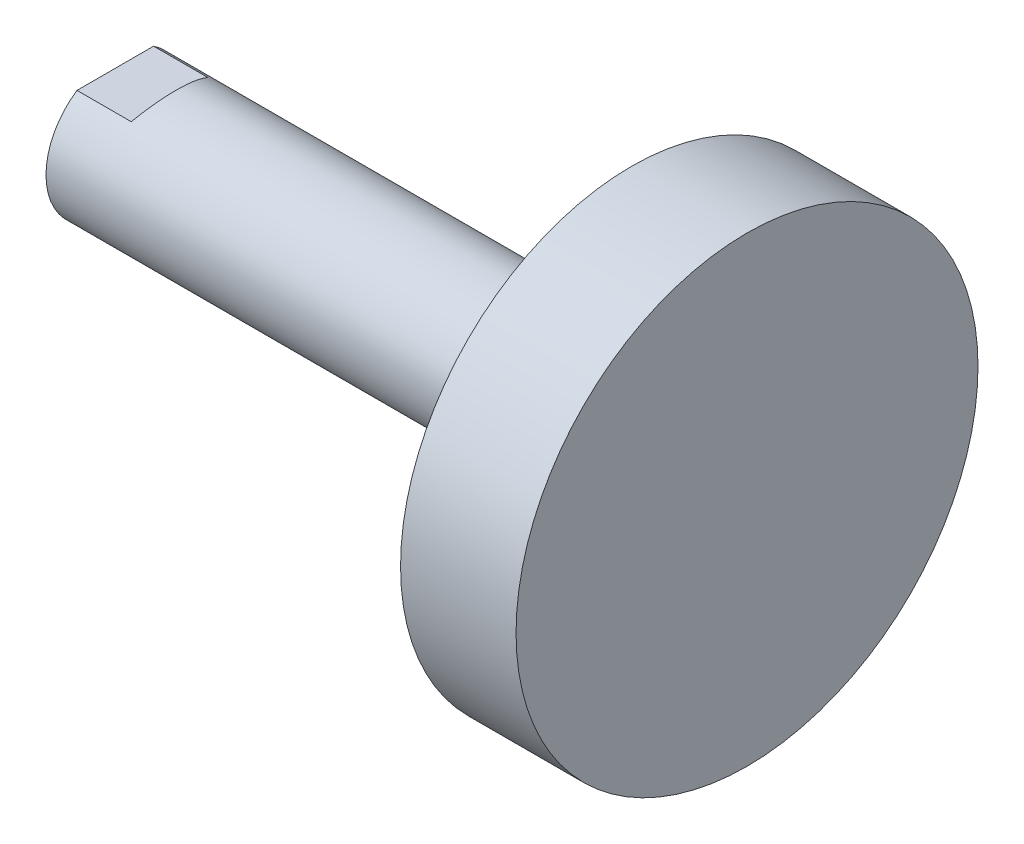
ISO-10303-21;
HEADER;
FILE_DESCRIPTION(('STEP AP214'),'2;1');
FILE_NAME('part.step','',(''),(''),'','','');
FILE_SCHEMA(('AUTOMOTIVE_DESIGN { 1 0 10303 214 1 1 1 1 }'));
ENDSEC;
DATA;
#1=APPLICATION_CONTEXT('core data for automotive mechanical design processes');
#2=APPLICATION_PROTOCOL_DEFINITION('international standard','automotive_design',2000,#1);
#3=PRODUCT_CONTEXT('',#1,'mechanical');
#4=PRODUCT('Part','Part','',(#3));
#5=PRODUCT_RELATED_PRODUCT_CATEGORY('part','',(#4));
#6=PRODUCT_DEFINITION_FORMATION('','',#4);
#7=PRODUCT_DEFINITION_CONTEXT('part definition',#1,'design');
#8=PRODUCT_DEFINITION('design','',#6,#7);
#9=PRODUCT_DEFINITION_SHAPE('','',#8);
#10=(LENGTH_UNIT() NAMED_UNIT(*) SI_UNIT(.MILLI.,.METRE.));
#11=(NAMED_UNIT(*) PLANE_ANGLE_UNIT() SI_UNIT($,.RADIAN.));
#12=(NAMED_UNIT(*) SI_UNIT($,.STERADIAN.) SOLID_ANGLE_UNIT());
#13=UNCERTAINTY_MEASURE_WITH_UNIT(LENGTH_MEASURE(1.E-05),#10,'distance_accuracy_value','');
#14=(GEOMETRIC_REPRESENTATION_CONTEXT(3) GLOBAL_UNCERTAINTY_ASSIGNED_CONTEXT((#13)) GLOBAL_UNIT_ASSIGNED_CONTEXT((#10,
#11,#12)) REPRESENTATION_CONTEXT('',''));
#15=CARTESIAN_POINT('',(0.,0.,0.));
#16=DIRECTION('',(0.,0.,1.));
#17=DIRECTION('',(1.,0.,0.));
#18=AXIS2_PLACEMENT_3D('',#15,#16,#17);
#19=CARTESIAN_POINT('',(-6.1,0.,0.));
#20=DIRECTION('',(1.,0.,0.));
#21=DIRECTION('',(0.,0.,-1.));
#22=AXIS2_PLACEMENT_3D('',#19,#20,#21);
#23=PLANE('',#22);
#24=CARTESIAN_POINT('',(-6.1,0.,0.));
#25=DIRECTION('',(-1.,0.,0.));
#26=DIRECTION('',(0.,0.,1.));
#27=AXIS2_PLACEMENT_3D('',#24,#25,#26);
#28=CIRCLE('',#27,6.);
#29=CARTESIAN_POINT('',(-6.1,-5.,3.3166247903554));
#30=VERTEX_POINT('',#29);
#31=CARTESIAN_POINT('',(-6.1,5.,3.3166247903554));
#32=VERTEX_POINT('',#31);
#33=EDGE_CURVE('E104',#30,#32,#28,.T.);
#34=ORIENTED_EDGE('',*,*,#33,.T.);
#35=DIRECTION('',(0.,0.,-1.));
#36=VECTOR('',#35,1.);
#37=CARTESIAN_POINT('',(-6.1,5.,0.));
#38=LINE('',#37,#36);
#39=CARTESIAN_POINT('',(-6.1,5.,-3.3166247903554));
#40=VERTEX_POINT('',#39);
#41=EDGE_CURVE('E142',#32,#40,#38,.T.);
#42=ORIENTED_EDGE('',*,*,#41,.T.);
#43=CARTESIAN_POINT('',(-6.1,-5.,-3.3166247903554));
#44=VERTEX_POINT('',#43);
#45=EDGE_CURVE('E136',#40,#44,#28,.T.);
#46=ORIENTED_EDGE('',*,*,#45,.T.);
#47=DIRECTION('',(0.,0.,1.));
#48=VECTOR('',#47,1.);
#49=CARTESIAN_POINT('',(-6.1,-5.,0.));
#50=LINE('',#49,#48);
#51=EDGE_CURVE('E140',#44,#30,#50,.T.);
#52=ORIENTED_EDGE('',*,*,#51,.T.);
#53=EDGE_LOOP('',(#34,#42,#46,#52));
#54=FACE_BOUND('',#53,.T.);
#55=CARTESIAN_POINT('',(-6.1,0.,0.));
#56=DIRECTION('',(-1.,0.,0.));
#57=DIRECTION('',(0.,0.,1.));
#58=AXIS2_PLACEMENT_3D('',#55,#56,#57);
#59=CIRCLE('',#58,4.8);
#60=CARTESIAN_POINT('',(-6.1,0.,4.8));
#61=VERTEX_POINT('',#60);
#62=EDGE_CURVE('E107',#61,#61,#59,.T.);
#63=ORIENTED_EDGE('',*,*,#62,.F.);
#64=EDGE_LOOP('',(#63));
#65=FACE_BOUND('',#64,.T.);
#66=ADVANCED_FACE('F38',(#54,#65),#23,.F.);
#67=CARTESIAN_POINT('',(48.6,0.,0.));
#68=DIRECTION('',(-1.,0.,0.));
#69=DIRECTION('',(0.,0.,1.));
#70=AXIS2_PLACEMENT_3D('',#67,#68,#69);
#71=CYLINDRICAL_SURFACE('',#70,6.);
#72=CARTESIAN_POINT('',(-4.28675134594813,0.,0.));
#73=DIRECTION('',(0.866025403784438,-0.500000000000001,0.));
#74=DIRECTION('',(-0.500000000000001,-0.866025403784438,0.));
#75=AXIS2_PLACEMENT_3D('',#72,#73,#74);
#76=ELLIPSE('',#75,6.92820323027551,6.);
#77=CARTESIAN_POINT('',(-1.4,5.,-3.3166247903554));
#78=VERTEX_POINT('',#77);
#79=CARTESIAN_POINT('',(-1.4,5.,3.3166247903554));
#80=VERTEX_POINT('',#79);
#81=EDGE_CURVE('E11',#78,#80,#76,.T.);
#82=ORIENTED_EDGE('',*,*,#81,.T.);
#83=DIRECTION('',(-1.,0.,0.));
#84=VECTOR('',#83,1.);
#85=CARTESIAN_POINT('',(48.6,5.,3.3166247903554));
#86=LINE('',#85,#84);
#87=EDGE_CURVE('E126',#80,#32,#86,.T.);
#88=ORIENTED_EDGE('',*,*,#87,.T.);
#89=ORIENTED_EDGE('',*,*,#33,.F.);
#90=DIRECTION('',(-1.,0.,0.));
#91=VECTOR('',#90,1.);
#92=CARTESIAN_POINT('',(48.6,-5.,3.3166247903554));
#93=LINE('',#92,#91);
#94=CARTESIAN_POINT('',(-1.4,-5.,3.3166247903554));
#95=VERTEX_POINT('',#94);
#96=EDGE_CURVE('E52',#30,#95,#93,.F.);
#97=ORIENTED_EDGE('',*,*,#96,.T.);
#98=CARTESIAN_POINT('',(-4.28675134594814,0.,0.));
#99=DIRECTION('',(0.866025403784438,0.500000000000001,0.));
#100=DIRECTION('',(-0.500000000000001,0.866025403784438,0.));
#101=AXIS2_PLACEMENT_3D('',#98,#99,#100);
#102=ELLIPSE('',#101,6.92820323027551,6.);
#103=CARTESIAN_POINT('',(-1.4,-5.,-3.31662479035539));
#104=VERTEX_POINT('',#103);
#105=EDGE_CURVE('E45',#95,#104,#102,.T.);
#106=ORIENTED_EDGE('',*,*,#105,.T.);
#107=DIRECTION('',(-1.,0.,0.));
#108=VECTOR('',#107,1.);
#109=CARTESIAN_POINT('',(48.6,-5.,-3.3166247903554));
#110=LINE('',#109,#108);
#111=EDGE_CURVE('E122',#104,#44,#110,.T.);
#112=ORIENTED_EDGE('',*,*,#111,.T.);
#113=ORIENTED_EDGE('',*,*,#45,.F.);
#114=DIRECTION('',(-1.,0.,0.));
#115=VECTOR('',#114,1.);
#116=CARTESIAN_POINT('',(48.6,5.,-3.3166247903554));
#117=LINE('',#116,#115);
#118=EDGE_CURVE('E60',#40,#78,#117,.F.);
#119=ORIENTED_EDGE('',*,*,#118,.T.);
#120=EDGE_LOOP('',(#82,#88,#89,#97,#106,#112,#113,#119));
#121=FACE_BOUND('',#120,.T.);
#122=CARTESIAN_POINT('',(38.6,0.,0.));
#123=DIRECTION('',(1.,0.,0.));
#124=DIRECTION('',(0.,0.,-1.));
#125=AXIS2_PLACEMENT_3D('',#122,#123,#124);
#126=CIRCLE('',#125,6.);
#127=CARTESIAN_POINT('',(38.6,0.,-6.));
#128=VERTEX_POINT('',#127);
#129=EDGE_CURVE('E137',#128,#128,#126,.T.);
#130=ORIENTED_EDGE('',*,*,#129,.F.);
#131=EDGE_LOOP('',(#130));
#132=FACE_BOUND('',#131,.T.);
#133=ADVANCED_FACE('F94',(#121,#132),#71,.T.);
#134=CARTESIAN_POINT('',(38.6,0.,0.));
#135=DIRECTION('',(1.,0.,0.));
#136=DIRECTION('',(0.,0.,-1.));
#137=AXIS2_PLACEMENT_3D('',#134,#135,#136);
#138=PLANE('',#137);
#139=CARTESIAN_POINT('',(38.6,0.,0.));
#140=DIRECTION('',(-1.,0.,0.));
#141=DIRECTION('',(0.,0.,1.));
#142=AXIS2_PLACEMENT_3D('',#139,#140,#141);
#143=CIRCLE('',#142,20.);
#144=CARTESIAN_POINT('',(38.6,0.,20.));
#145=VERTEX_POINT('',#144);
#146=EDGE_CURVE('E132',#145,#145,#143,.T.);
#147=ORIENTED_EDGE('',*,*,#146,.T.);
#148=EDGE_LOOP('',(#147));
#149=FACE_BOUND('',#148,.T.);
#150=ORIENTED_EDGE('',*,*,#129,.T.);
#151=EDGE_LOOP('',(#150));
#152=FACE_BOUND('',#151,.T.);
#153=ADVANCED_FACE('F99',(#149,#152),#138,.F.);
#154=CARTESIAN_POINT('',(48.6,0.,0.));
#155=DIRECTION('',(-1.,0.,0.));
#156=DIRECTION('',(0.,0.,1.));
#157=AXIS2_PLACEMENT_3D('',#154,#155,#156);
#158=CYLINDRICAL_SURFACE('',#157,20.);
#159=ORIENTED_EDGE('',*,*,#146,.F.);
#160=EDGE_LOOP('',(#159));
#161=FACE_BOUND('',#160,.T.);
#162=CARTESIAN_POINT('',(48.6,0.,0.));
#163=DIRECTION('',(-1.,0.,0.));
#164=DIRECTION('',(0.,0.,1.));
#165=AXIS2_PLACEMENT_3D('',#162,#163,#164);
#166=CIRCLE('',#165,20.);
#167=CARTESIAN_POINT('',(48.6,0.,20.));
#168=VERTEX_POINT('',#167);
#169=EDGE_CURVE('E129',#168,#168,#166,.T.);
#170=ORIENTED_EDGE('',*,*,#169,.T.);
#171=EDGE_LOOP('',(#170));
#172=FACE_BOUND('',#171,.T.);
#173=ADVANCED_FACE('F169',(#161,#172),#158,.T.);
#174=CARTESIAN_POINT('',(48.6,6.,0.));
#175=DIRECTION('',(-1.,0.,0.));
#176=DIRECTION('',(0.,0.,1.));
#177=AXIS2_PLACEMENT_3D('',#174,#175,#176);
#178=PLANE('',#177);
#179=ORIENTED_EDGE('',*,*,#169,.F.);
#180=EDGE_LOOP('',(#179));
#181=FACE_BOUND('',#180,.T.);
#182=ADVANCED_FACE('F167',(#181),#178,.F.);
#183=CARTESIAN_POINT('',(-1.4,-5.,-12.));
#184=DIRECTION('',(0.,1.,0.));
#185=DIRECTION('',(0.,0.,1.));
#186=AXIS2_PLACEMENT_3D('',#183,#184,#185);
#187=PLANE('',#186);
#188=DIRECTION('',(0.,0.,1.));
#189=VECTOR('',#188,1.);
#190=CARTESIAN_POINT('',(-1.4,-5.,-12.));
#191=LINE('',#190,#189);
#192=EDGE_CURVE('E109',#104,#95,#191,.T.);
#193=ORIENTED_EDGE('',*,*,#192,.T.);
#194=ORIENTED_EDGE('',*,*,#96,.F.);
#195=ORIENTED_EDGE('',*,*,#51,.F.);
#196=ORIENTED_EDGE('',*,*,#111,.F.);
#197=EDGE_LOOP('',(#193,#194,#195,#196));
#198=FACE_BOUND('',#197,.T.);
#199=ADVANCED_FACE('F150',(#198),#187,.F.);
#200=CARTESIAN_POINT('',(4.9508529610859,-16.,-12.));
#201=DIRECTION('',(0.866025403784438,0.500000000000001,0.));
#202=DIRECTION('',(-0.500000000000001,0.866025403784438,0.));
#203=AXIS2_PLACEMENT_3D('',#200,#201,#202);
#204=PLANE('',#203);
#205=ORIENTED_EDGE('',*,*,#192,.F.);
#206=ORIENTED_EDGE('',*,*,#105,.F.);
#207=EDGE_LOOP('',(#205,#206));
#208=FACE_BOUND('',#207,.T.);
#209=ADVANCED_FACE('F149',(#208),#204,.F.);
#210=CARTESIAN_POINT('',(-1.4,5.,-12.));
#211=DIRECTION('',(0.866025403784438,-0.500000000000001,0.));
#212=DIRECTION('',(0.500000000000001,0.866025403784438,0.));
#213=AXIS2_PLACEMENT_3D('',#210,#211,#212);
#214=PLANE('',#213);
#215=DIRECTION('',(0.,0.,1.));
#216=VECTOR('',#215,1.);
#217=CARTESIAN_POINT('',(-1.4,5.,-12.));
#218=LINE('',#217,#216);
#219=EDGE_CURVE('E112',#78,#80,#218,.T.);
#220=ORIENTED_EDGE('',*,*,#219,.T.);
#221=ORIENTED_EDGE('',*,*,#81,.F.);
#222=EDGE_LOOP('',(#220,#221));
#223=FACE_BOUND('',#222,.T.);
#224=ADVANCED_FACE('F153',(#223),#214,.F.);
#225=CARTESIAN_POINT('',(-6.1,5.,-12.));
#226=DIRECTION('',(0.,-1.,0.));
#227=DIRECTION('',(0.,0.,-1.));
#228=AXIS2_PLACEMENT_3D('',#225,#226,#227);
#229=PLANE('',#228);
#230=ORIENTED_EDGE('',*,*,#219,.F.);
#231=ORIENTED_EDGE('',*,*,#118,.F.);
#232=ORIENTED_EDGE('',*,*,#41,.F.);
#233=ORIENTED_EDGE('',*,*,#87,.F.);
#234=EDGE_LOOP('',(#230,#231,#232,#233));
#235=FACE_BOUND('',#234,.T.);
#236=ADVANCED_FACE('F151',(#235),#229,.F.);
#237=CARTESIAN_POINT('',(-5.5,0.,0.));
#238=DIRECTION('',(-1.,0.,0.));
#239=DIRECTION('',(0.,0.,1.));
#240=AXIS2_PLACEMENT_3D('',#237,#238,#239);
#241=CONICAL_SURFACE('',#240,4.2,0.785398163397445);
#242=ORIENTED_EDGE('',*,*,#62,.T.);
#243=EDGE_LOOP('',(#242));
#244=FACE_BOUND('',#243,.T.);
#245=CARTESIAN_POINT('',(-5.5,0.,0.));
#246=DIRECTION('',(-1.,0.,0.));
#247=DIRECTION('',(0.,0.,1.));
#248=AXIS2_PLACEMENT_3D('',#245,#246,#247);
#249=CIRCLE('',#248,4.2);
#250=CARTESIAN_POINT('',(-5.5,0.,4.2));
#251=VERTEX_POINT('',#250);
#252=EDGE_CURVE('E110',#251,#251,#249,.T.);
#253=ORIENTED_EDGE('',*,*,#252,.F.);
#254=EDGE_LOOP('',(#253));
#255=FACE_BOUND('',#254,.T.);
#256=ADVANCED_FACE('F160',(#244,#255),#241,.F.);
#257=CARTESIAN_POINT('',(15.818823619652,0.,0.));
#258=DIRECTION('',(-1.,0.,0.));
#259=DIRECTION('',(0.,0.,1.));
#260=AXIS2_PLACEMENT_3D('',#257,#258,#259);
#261=CYLINDRICAL_SURFACE('',#260,4.2);
#262=ORIENTED_EDGE('',*,*,#252,.T.);
#263=EDGE_LOOP('',(#262));
#264=FACE_BOUND('',#263,.T.);
#265=CARTESIAN_POINT('',(-2.8,0.,0.));
#266=DIRECTION('',(-1.,0.,0.));
#267=DIRECTION('',(0.,0.,1.));
#268=AXIS2_PLACEMENT_3D('',#265,#266,#267);
#269=CIRCLE('',#268,4.2);
#270=CARTESIAN_POINT('',(-2.8,0.,4.2));
#271=VERTEX_POINT('',#270);
#272=EDGE_CURVE('E115',#271,#271,#269,.T.);
#273=ORIENTED_EDGE('',*,*,#272,.F.);
#274=EDGE_LOOP('',(#273));
#275=FACE_BOUND('',#274,.T.);
#276=ADVANCED_FACE('F229',(#264,#275),#261,.F.);
#277=CARTESIAN_POINT('',(-2.8,4.2,0.));
#278=DIRECTION('',(-1.,0.,0.));
#279=DIRECTION('',(0.,0.,1.));
#280=AXIS2_PLACEMENT_3D('',#277,#278,#279);
#281=PLANE('',#280);
#282=ORIENTED_EDGE('',*,*,#272,.T.);
#283=EDGE_LOOP('',(#282));
#284=FACE_BOUND('',#283,.T.);
#285=CARTESIAN_POINT('',(-2.8,0.,0.));
#286=DIRECTION('',(-1.,0.,0.));
#287=DIRECTION('',(0.,0.,1.));
#288=AXIS2_PLACEMENT_3D('',#285,#286,#287);
#289=CIRCLE('',#288,4.);
#290=CARTESIAN_POINT('',(-2.8,0.,4.));
#291=VERTEX_POINT('',#290);
#292=EDGE_CURVE('E315',#291,#291,#289,.T.);
#293=ORIENTED_EDGE('',*,*,#292,.F.);
#294=EDGE_LOOP('',(#293));
#295=FACE_BOUND('',#294,.T.);
#296=ADVANCED_FACE('F239',(#284,#295),#281,.T.);
#297=CARTESIAN_POINT('',(-2.1235,0.,0.));
#298=DIRECTION('',(-1.,0.,0.));
#299=DIRECTION('',(0.,0.,1.));
#300=AXIS2_PLACEMENT_3D('',#297,#298,#299);
#301=CONICAL_SURFACE('',#300,3.3235,0.785398163397448);
#302=ORIENTED_EDGE('',*,*,#292,.T.);
#303=EDGE_LOOP('',(#302));
#304=FACE_BOUND('',#303,.T.);
#305=CARTESIAN_POINT('',(-2.1235,0.,0.));
#306=DIRECTION('',(-1.,0.,0.));
#307=DIRECTION('',(0.,0.,1.));
#308=AXIS2_PLACEMENT_3D('',#305,#306,#307);
#309=CIRCLE('',#308,3.3235);
#310=CARTESIAN_POINT('',(-2.1235,0.,3.3235));
#311=VERTEX_POINT('',#310);
#312=EDGE_CURVE('E318',#311,#311,#309,.T.);
#313=ORIENTED_EDGE('',*,*,#312,.F.);
#314=EDGE_LOOP('',(#313));
#315=FACE_BOUND('',#314,.T.);
#316=ADVANCED_FACE('F89',(#304,#315),#301,.F.);
#317=CARTESIAN_POINT('',(15.818823619652,0.,0.));
#318=DIRECTION('',(-1.,0.,0.));
#319=DIRECTION('',(0.,0.,1.));
#320=AXIS2_PLACEMENT_3D('',#317,#318,#319);
#321=CYLINDRICAL_SURFACE('',#320,3.3235);
#322=ORIENTED_EDGE('',*,*,#312,.T.);
#323=EDGE_LOOP('',(#322));
#324=FACE_BOUND('',#323,.T.);
#325=CARTESIAN_POINT('',(13.9,0.,0.));
#326=DIRECTION('',(-1.,0.,0.));
#327=DIRECTION('',(0.,0.,1.));
#328=AXIS2_PLACEMENT_3D('',#325,#326,#327);
#329=CIRCLE('',#328,3.3235);
#330=CARTESIAN_POINT('',(13.9,0.,3.3235));
#331=VERTEX_POINT('',#330);
#332=EDGE_CURVE('E319',#331,#331,#329,.T.);
#333=ORIENTED_EDGE('',*,*,#332,.F.);
#334=EDGE_LOOP('',(#333));
#335=FACE_BOUND('',#334,.T.);
#336=ADVANCED_FACE('F83',(#324,#335),#321,.F.);
#337=CARTESIAN_POINT('',(15.818823619652,0.,0.));
#338=DIRECTION('',(-1.,0.,0.));
#339=DIRECTION('',(0.,0.,1.));
#340=AXIS2_PLACEMENT_3D('',#337,#338,#339);
#341=CONICAL_SURFACE('',#340,0.,1.04719755119654);
#342=ORIENTED_EDGE('',*,*,#332,.T.);
#343=EDGE_LOOP('',(#342));
#344=FACE_BOUND('',#343,.T.);
#345=CARTESIAN_POINT('',(15.818823619652,0.,0.));
#346=VERTEX_POINT('',#345);
#347=VERTEX_LOOP('',#346);
#348=FACE_BOUND('',#347,.T.);
#349=ADVANCED_FACE('F81',(#344,#348),#341,.F.);
#350=CLOSED_SHELL('',(#66,#133,#153,#173,#182,#199,#209,#224,#236,#256,#276,#296,#316,#336,#349));
#351=MANIFOLD_SOLID_BREP('B2',#350);
#352=ADVANCED_BREP_SHAPE_REPRESENTATION('',(#18,#351),#14);
#353=SHAPE_DEFINITION_REPRESENTATION(#9,#352);
ENDSEC;
END-ISO-10303-21;
